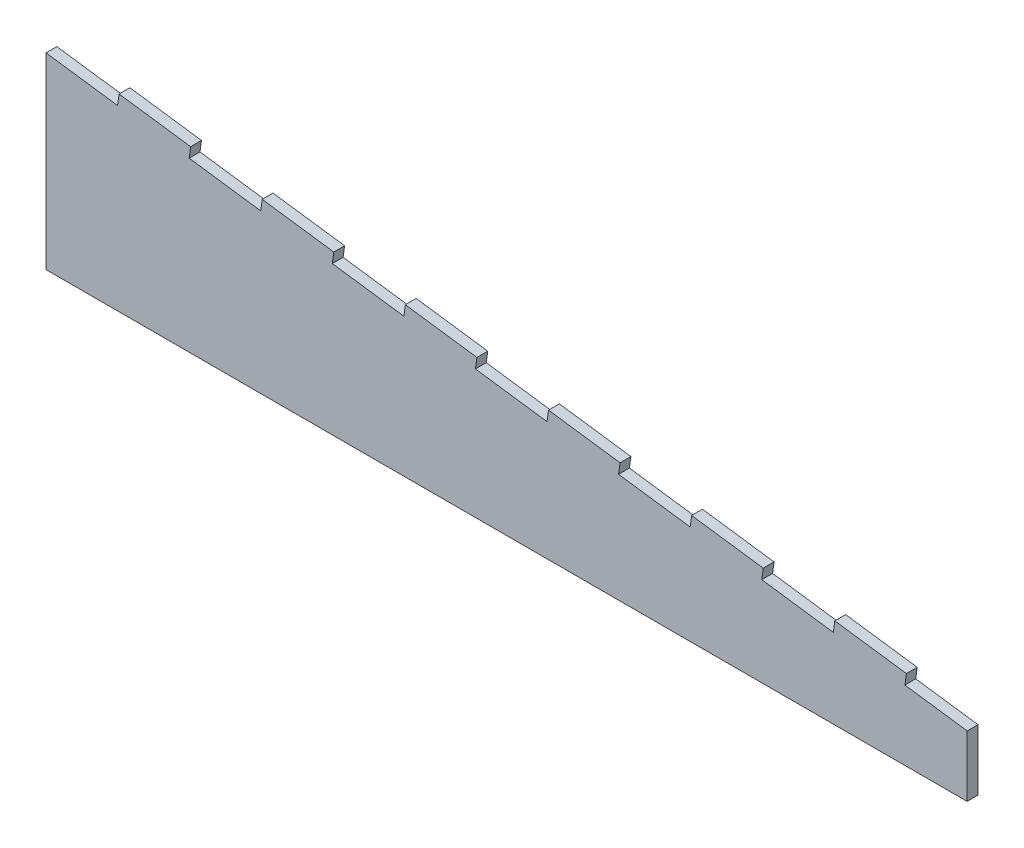
ISO-10303-21;
HEADER;
FILE_DESCRIPTION(('STEP AP214'),'2;1');
FILE_NAME('part.step','',(''),(''),'','','');
FILE_SCHEMA(('AUTOMOTIVE_DESIGN { 1 0 10303 214 1 1 1 1 }'));
ENDSEC;
DATA;
#1=APPLICATION_CONTEXT('core data for automotive mechanical design processes');
#2=APPLICATION_PROTOCOL_DEFINITION('international standard','automotive_design',2000,#1);
#3=PRODUCT_CONTEXT('',#1,'mechanical');
#4=PRODUCT('Part','Part','',(#3));
#5=PRODUCT_RELATED_PRODUCT_CATEGORY('part','',(#4));
#6=PRODUCT_DEFINITION_FORMATION('','',#4);
#7=PRODUCT_DEFINITION_CONTEXT('part definition',#1,'design');
#8=PRODUCT_DEFINITION('design','',#6,#7);
#9=PRODUCT_DEFINITION_SHAPE('','',#8);
#10=(LENGTH_UNIT() NAMED_UNIT(*) SI_UNIT(.MILLI.,.METRE.));
#11=(NAMED_UNIT(*) PLANE_ANGLE_UNIT() SI_UNIT($,.RADIAN.));
#12=(NAMED_UNIT(*) SI_UNIT($,.STERADIAN.) SOLID_ANGLE_UNIT());
#13=UNCERTAINTY_MEASURE_WITH_UNIT(LENGTH_MEASURE(1.E-05),#10,'distance_accuracy_value','');
#14=(GEOMETRIC_REPRESENTATION_CONTEXT(3) GLOBAL_UNCERTAINTY_ASSIGNED_CONTEXT((#13)) GLOBAL_UNIT_ASSIGNED_CONTEXT((#10,
#11,#12)) REPRESENTATION_CONTEXT('',''));
#15=CARTESIAN_POINT('',(0.,0.,0.));
#16=DIRECTION('',(0.,0.,1.));
#17=DIRECTION('',(1.,0.,0.));
#18=AXIS2_PLACEMENT_3D('',#15,#16,#17);
#19=CARTESIAN_POINT('',(0.,19.9375,3.));
#20=DIRECTION('',(-1.,0.,0.));
#21=DIRECTION('',(0.,-1.,0.));
#22=AXIS2_PLACEMENT_3D('',#19,#20,#21);
#23=PLANE('',#22);
#24=DIRECTION('',(0.,0.,1.));
#25=VECTOR('',#24,1.);
#26=CARTESIAN_POINT('',(0.,16.9092734150166,0.));
#27=LINE('',#26,#25);
#28=CARTESIAN_POINT('',(0.,16.9092734150166,0.));
#29=VERTEX_POINT('',#28);
#30=CARTESIAN_POINT('',(0.,16.9092734150166,3.));
#31=VERTEX_POINT('',#30);
#32=EDGE_CURVE('E381',#29,#31,#27,.T.);
#33=ORIENTED_EDGE('',*,*,#32,.T.);
#34=DIRECTION('',(0.,1.,0.));
#35=VECTOR('',#34,1.);
#36=CARTESIAN_POINT('',(0.,19.9375,3.));
#37=LINE('',#36,#35);
#38=CARTESIAN_POINT('',(0.,0.,3.));
#39=VERTEX_POINT('',#38);
#40=EDGE_CURVE('E392',#39,#31,#37,.T.);
#41=ORIENTED_EDGE('',*,*,#40,.F.);
#42=DIRECTION('',(0.,0.,-1.));
#43=VECTOR('',#42,1.);
#44=CARTESIAN_POINT('',(0.,0.,3.));
#45=LINE('',#44,#43);
#46=CARTESIAN_POINT('',(0.,0.,0.));
#47=VERTEX_POINT('',#46);
#48=EDGE_CURVE('E46',#39,#47,#45,.T.);
#49=ORIENTED_EDGE('',*,*,#48,.T.);
#50=DIRECTION('',(0.,1.,0.));
#51=VECTOR('',#50,1.);
#52=CARTESIAN_POINT('',(0.,19.9375,0.));
#53=LINE('',#52,#51);
#54=EDGE_CURVE('E250',#47,#29,#53,.T.);
#55=ORIENTED_EDGE('',*,*,#54,.T.);
#56=EDGE_LOOP('',(#33,#41,#49,#55));
#57=FACE_BOUND('',#56,.T.);
#58=ADVANCED_FACE('F39',(#57),#23,.F.);
#59=CARTESIAN_POINT('',(-255.,55.,3.));
#60=DIRECTION('',(-0.136218340478728,-0.990678839845296,0.));
#61=DIRECTION('',(0.990678839845296,-0.136218340478728,0.));
#62=AXIS2_PLACEMENT_3D('',#59,#60,#61);
#63=PLANE('',#62);
#64=DIRECTION('',(0.,0.,1.));
#65=VECTOR('',#64,1.);
#66=CARTESIAN_POINT('',(-234.777768181658,52.2194431249779,0.));
#67=LINE('',#66,#65);
#68=CARTESIAN_POINT('',(-234.777768181658,52.2194431249779,0.));
#69=VERTEX_POINT('',#68);
#70=CARTESIAN_POINT('',(-234.777768181658,52.2194431249779,3.));
#71=VERTEX_POINT('',#70);
#72=EDGE_CURVE('E61',#69,#71,#67,.T.);
#73=ORIENTED_EDGE('',*,*,#72,.T.);
#74=DIRECTION('',(-0.990678839845296,0.136218340478728,0.));
#75=VECTOR('',#74,1.);
#76=CARTESIAN_POINT('',(-255.,55.,3.));
#77=LINE('',#76,#75);
#78=CARTESIAN_POINT('',(-214.964191384752,49.4950763154034,3.));
#79=VERTEX_POINT('',#78);
#80=EDGE_CURVE('E395',#79,#71,#77,.T.);
#81=ORIENTED_EDGE('',*,*,#80,.F.);
#82=DIRECTION('',(0.,0.,1.));
#83=VECTOR('',#82,1.);
#84=CARTESIAN_POINT('',(-214.964191384752,49.4950763154034,0.));
#85=LINE('',#84,#83);
#86=CARTESIAN_POINT('',(-214.964191384752,49.4950763154034,0.));
#87=VERTEX_POINT('',#86);
#88=EDGE_CURVE('E271',#87,#79,#85,.T.);
#89=ORIENTED_EDGE('',*,*,#88,.F.);
#90=DIRECTION('',(-0.990678839845296,0.136218340478728,0.));
#91=VECTOR('',#90,1.);
#92=CARTESIAN_POINT('',(-255.,55.,0.));
#93=LINE('',#92,#91);
#94=EDGE_CURVE('E407',#87,#69,#93,.T.);
#95=ORIENTED_EDGE('',*,*,#94,.T.);
#96=EDGE_LOOP('',(#73,#81,#89,#95));
#97=FACE_BOUND('',#96,.T.);
#98=ADVANCED_FACE('F433',(#97),#63,.F.);
#99=DIRECTION('',(0.,0.,1.));
#100=VECTOR('',#99,1.);
#101=CARTESIAN_POINT('',(-195.150614587846,46.7707095058288,0.));
#102=LINE('',#101,#100);
#103=CARTESIAN_POINT('',(-195.150614587846,46.7707095058288,0.));
#104=VERTEX_POINT('',#103);
#105=CARTESIAN_POINT('',(-195.150614587846,46.7707095058288,3.));
#106=VERTEX_POINT('',#105);
#107=EDGE_CURVE('E273',#104,#106,#102,.T.);
#108=ORIENTED_EDGE('',*,*,#107,.T.);
#109=CARTESIAN_POINT('',(-175.33703779094,44.0463426962542,3.));
#110=VERTEX_POINT('',#109);
#111=EDGE_CURVE('E399',#110,#106,#77,.T.);
#112=ORIENTED_EDGE('',*,*,#111,.F.);
#113=DIRECTION('',(0.,0.,1.));
#114=VECTOR('',#113,1.);
#115=CARTESIAN_POINT('',(-175.33703779094,44.0463426962542,0.));
#116=LINE('',#115,#114);
#117=CARTESIAN_POINT('',(-175.33703779094,44.0463426962542,0.));
#118=VERTEX_POINT('',#117);
#119=EDGE_CURVE('E296',#118,#110,#116,.T.);
#120=ORIENTED_EDGE('',*,*,#119,.F.);
#121=EDGE_CURVE('E409',#118,#104,#93,.T.);
#122=ORIENTED_EDGE('',*,*,#121,.T.);
#123=EDGE_LOOP('',(#108,#112,#120,#122));
#124=FACE_BOUND('',#123,.T.);
#125=ADVANCED_FACE('F451',(#124),#63,.F.);
#126=DIRECTION('',(0.,0.,1.));
#127=VECTOR('',#126,1.);
#128=CARTESIAN_POINT('',(-155.523460994034,41.3219758866797,0.));
#129=LINE('',#128,#127);
#130=CARTESIAN_POINT('',(-155.523460994034,41.3219758866797,0.));
#131=VERTEX_POINT('',#130);
#132=CARTESIAN_POINT('',(-155.523460994034,41.3219758866797,3.));
#133=VERTEX_POINT('',#132);
#134=EDGE_CURVE('E298',#131,#133,#129,.T.);
#135=ORIENTED_EDGE('',*,*,#134,.T.);
#136=CARTESIAN_POINT('',(-135.709884197128,38.5976090771051,3.));
#137=VERTEX_POINT('',#136);
#138=EDGE_CURVE('E491',#137,#133,#77,.T.);
#139=ORIENTED_EDGE('',*,*,#138,.F.);
#140=DIRECTION('',(0.,0.,1.));
#141=VECTOR('',#140,1.);
#142=CARTESIAN_POINT('',(-135.709884197128,38.5976090771051,0.));
#143=LINE('',#142,#141);
#144=CARTESIAN_POINT('',(-135.709884197128,38.5976090771051,0.));
#145=VERTEX_POINT('',#144);
#146=EDGE_CURVE('E321',#145,#137,#143,.T.);
#147=ORIENTED_EDGE('',*,*,#146,.F.);
#148=EDGE_CURVE('E455',#145,#131,#93,.T.);
#149=ORIENTED_EDGE('',*,*,#148,.T.);
#150=EDGE_LOOP('',(#135,#139,#147,#149));
#151=FACE_BOUND('',#150,.T.);
#152=ADVANCED_FACE('F495',(#151),#63,.F.);
#153=DIRECTION('',(0.,0.,1.));
#154=VECTOR('',#153,1.);
#155=CARTESIAN_POINT('',(-115.896307400223,35.8732422675306,0.));
#156=LINE('',#155,#154);
#157=CARTESIAN_POINT('',(-115.896307400223,35.8732422675306,0.));
#158=VERTEX_POINT('',#157);
#159=CARTESIAN_POINT('',(-115.896307400223,35.8732422675306,3.));
#160=VERTEX_POINT('',#159);
#161=EDGE_CURVE('E323',#158,#160,#156,.T.);
#162=ORIENTED_EDGE('',*,*,#161,.T.);
#163=CARTESIAN_POINT('',(-96.0827306033167,33.148875457956,3.));
#164=VERTEX_POINT('',#163);
#165=EDGE_CURVE('E488',#164,#160,#77,.T.);
#166=ORIENTED_EDGE('',*,*,#165,.F.);
#167=DIRECTION('',(0.,0.,1.));
#168=VECTOR('',#167,1.);
#169=CARTESIAN_POINT('',(-96.0827306033167,33.148875457956,0.));
#170=LINE('',#169,#168);
#171=CARTESIAN_POINT('',(-96.0827306033167,33.148875457956,0.));
#172=VERTEX_POINT('',#171);
#173=EDGE_CURVE('E346',#172,#164,#170,.T.);
#174=ORIENTED_EDGE('',*,*,#173,.F.);
#175=EDGE_CURVE('E457',#172,#158,#93,.T.);
#176=ORIENTED_EDGE('',*,*,#175,.T.);
#177=EDGE_LOOP('',(#162,#166,#174,#176));
#178=FACE_BOUND('',#177,.T.);
#179=ADVANCED_FACE('F533',(#178),#63,.F.);
#180=DIRECTION('',(0.,0.,1.));
#181=VECTOR('',#180,1.);
#182=CARTESIAN_POINT('',(-76.2691538064108,30.4245086483814,0.));
#183=LINE('',#182,#181);
#184=CARTESIAN_POINT('',(-76.2691538064107,30.4245086483814,0.));
#185=VERTEX_POINT('',#184);
#186=CARTESIAN_POINT('',(-76.2691538064108,30.4245086483814,3.));
#187=VERTEX_POINT('',#186);
#188=EDGE_CURVE('E348',#185,#187,#183,.T.);
#189=ORIENTED_EDGE('',*,*,#188,.T.);
#190=CARTESIAN_POINT('',(-56.4555770095048,27.7001418388069,3.));
#191=VERTEX_POINT('',#190);
#192=EDGE_CURVE('E486',#191,#187,#77,.T.);
#193=ORIENTED_EDGE('',*,*,#192,.F.);
#194=DIRECTION('',(0.,0.,1.));
#195=VECTOR('',#194,1.);
#196=CARTESIAN_POINT('',(-56.4555770095048,27.7001418388069,0.));
#197=LINE('',#196,#195);
#198=CARTESIAN_POINT('',(-56.4555770095048,27.7001418388069,0.));
#199=VERTEX_POINT('',#198);
#200=EDGE_CURVE('E370',#199,#191,#197,.T.);
#201=ORIENTED_EDGE('',*,*,#200,.F.);
#202=EDGE_CURVE('E462',#199,#185,#93,.T.);
#203=ORIENTED_EDGE('',*,*,#202,.T.);
#204=EDGE_LOOP('',(#189,#193,#201,#203));
#205=FACE_BOUND('',#204,.T.);
#206=ADVANCED_FACE('F528',(#205),#63,.F.);
#207=DIRECTION('',(0.,0.,1.));
#208=VECTOR('',#207,1.);
#209=CARTESIAN_POINT('',(-36.6420002125989,24.9757750292323,0.));
#210=LINE('',#209,#208);
#211=CARTESIAN_POINT('',(-36.6420002125989,24.9757750292323,0.));
#212=VERTEX_POINT('',#211);
#213=CARTESIAN_POINT('',(-36.6420002125989,24.9757750292323,3.));
#214=VERTEX_POINT('',#213);
#215=EDGE_CURVE('E372',#212,#214,#210,.T.);
#216=ORIENTED_EDGE('',*,*,#215,.T.);
#217=CARTESIAN_POINT('',(-16.828423415693,22.2514082196578,3.));
#218=VERTEX_POINT('',#217);
#219=EDGE_CURVE('E400',#218,#214,#77,.T.);
#220=ORIENTED_EDGE('',*,*,#219,.F.);
#221=DIRECTION('',(0.,0.,1.));
#222=VECTOR('',#221,1.);
#223=CARTESIAN_POINT('',(-16.828423415693,22.2514082196578,0.));
#224=LINE('',#223,#222);
#225=CARTESIAN_POINT('',(-16.828423415693,22.2514082196578,0.));
#226=VERTEX_POINT('',#225);
#227=EDGE_CURVE('E388',#226,#218,#224,.T.);
#228=ORIENTED_EDGE('',*,*,#227,.F.);
#229=EDGE_CURVE('E410',#226,#212,#93,.T.);
#230=ORIENTED_EDGE('',*,*,#229,.T.);
#231=EDGE_LOOP('',(#216,#220,#228,#230));
#232=FACE_BOUND('',#231,.T.);
#233=ADVANCED_FACE('F473',(#232),#63,.F.);
#234=CARTESIAN_POINT('',(-255.,0.,3.));
#235=DIRECTION('',(1.,0.,0.));
#236=DIRECTION('',(0.,1.,0.));
#237=AXIS2_PLACEMENT_3D('',#234,#235,#236);
#238=PLANE('',#237);
#239=DIRECTION('',(0.,0.,1.));
#240=VECTOR('',#239,1.);
#241=CARTESIAN_POINT('',(-255.,51.9717734150166,0.));
#242=LINE('',#241,#240);
#243=CARTESIAN_POINT('',(-255.,51.9717734150166,0.));
#244=VERTEX_POINT('',#243);
#245=CARTESIAN_POINT('',(-255.,51.9717734150166,3.));
#246=VERTEX_POINT('',#245);
#247=EDGE_CURVE('E248',#244,#246,#242,.T.);
#248=ORIENTED_EDGE('',*,*,#247,.F.);
#249=DIRECTION('',(0.,-1.,0.));
#250=VECTOR('',#249,1.);
#251=CARTESIAN_POINT('',(-255.,0.,0.));
#252=LINE('',#251,#250);
#253=CARTESIAN_POINT('',(-255.,0.,0.));
#254=VERTEX_POINT('',#253);
#255=EDGE_CURVE('E241',#244,#254,#252,.T.);
#256=ORIENTED_EDGE('',*,*,#255,.T.);
#257=DIRECTION('',(0.,0.,-1.));
#258=VECTOR('',#257,1.);
#259=CARTESIAN_POINT('',(-255.,0.,3.));
#260=LINE('',#259,#258);
#261=CARTESIAN_POINT('',(-255.,0.,3.));
#262=VERTEX_POINT('',#261);
#263=EDGE_CURVE('E11',#262,#254,#260,.T.);
#264=ORIENTED_EDGE('',*,*,#263,.F.);
#265=DIRECTION('',(0.,-1.,0.));
#266=VECTOR('',#265,1.);
#267=CARTESIAN_POINT('',(-255.,0.,3.));
#268=LINE('',#267,#266);
#269=EDGE_CURVE('E401',#246,#262,#268,.T.);
#270=ORIENTED_EDGE('',*,*,#269,.F.);
#271=EDGE_LOOP('',(#248,#256,#264,#270));
#272=FACE_BOUND('',#271,.T.);
#273=ADVANCED_FACE('F430',(#272),#238,.F.);
#274=CARTESIAN_POINT('',(0.,0.,3.));
#275=DIRECTION('',(0.,0.,-1.));
#276=DIRECTION('',(-1.,0.,0.));
#277=AXIS2_PLACEMENT_3D('',#274,#275,#276);
#278=PLANE('',#277);
#279=DIRECTION('',(-0.990678839845296,0.136218340478728,0.));
#280=VECTOR('',#279,1.);
#281=CARTESIAN_POINT('',(2.28188323956673,16.5955144695763,3.));
#282=LINE('',#281,#280);
#283=CARTESIAN_POINT('',(-235.186423203094,49.247406605442,3.));
#284=VERTEX_POINT('',#283);
#285=EDGE_CURVE('E235',#284,#246,#282,.T.);
#286=ORIENTED_EDGE('',*,*,#285,.T.);
#287=ORIENTED_EDGE('',*,*,#269,.T.);
#288=DIRECTION('',(1.,0.,0.));
#289=VECTOR('',#288,1.);
#290=CARTESIAN_POINT('',(0.,0.,3.));
#291=LINE('',#290,#289);
#292=EDGE_CURVE('E403',#262,#39,#291,.T.);
#293=ORIENTED_EDGE('',*,*,#292,.T.);
#294=ORIENTED_EDGE('',*,*,#40,.T.);
#295=DIRECTION('',(-0.990678839845295,0.136218340478732,0.));
#296=VECTOR('',#295,1.);
#297=CARTESIAN_POINT('',(2.2818832395668,16.5955144695762,3.));
#298=LINE('',#297,#296);
#299=CARTESIAN_POINT('',(-17.2370784371292,19.279371700122,3.));
#300=VERTEX_POINT('',#299);
#301=EDGE_CURVE('E382',#31,#300,#298,.T.);
#302=ORIENTED_EDGE('',*,*,#301,.T.);
#303=DIRECTION('',(0.136218340478731,0.990678839845296,0.));
#304=VECTOR('',#303,1.);
#305=CARTESIAN_POINT('',(-19.5189616766959,2.68385723054575,3.));
#306=LINE('',#305,#304);
#307=EDGE_CURVE('E379',#300,#218,#306,.T.);
#308=ORIENTED_EDGE('',*,*,#307,.T.);
#309=ORIENTED_EDGE('',*,*,#219,.T.);
#310=DIRECTION('',(-0.136218340478728,-0.990678839845296,0.));
#311=VECTOR('',#310,1.);
#312=CARTESIAN_POINT('',(-39.3325384736018,5.40822404012023,3.));
#313=LINE('',#312,#311);
#314=CARTESIAN_POINT('',(-37.0506552340351,22.0037385096965,3.));
#315=VERTEX_POINT('',#314);
#316=EDGE_CURVE('E363',#214,#315,#313,.T.);
#317=ORIENTED_EDGE('',*,*,#316,.T.);
#318=DIRECTION('',(-0.990678839845296,0.136218340478727,0.));
#319=VECTOR('',#318,1.);
#320=CARTESIAN_POINT('',(2.28188323956673,16.5955144695763,3.));
#321=LINE('',#320,#319);
#322=CARTESIAN_POINT('',(-56.864232030941,24.7281053192711,3.));
#323=VERTEX_POINT('',#322);
#324=EDGE_CURVE('E360',#315,#323,#321,.T.);
#325=ORIENTED_EDGE('',*,*,#324,.T.);
#326=DIRECTION('',(0.136218340478727,0.990678839845296,0.));
#327=VECTOR('',#326,1.);
#328=CARTESIAN_POINT('',(-59.1461152705077,8.13259084969477,3.));
#329=LINE('',#328,#327);
#330=EDGE_CURVE('E355',#323,#191,#329,.T.);
#331=ORIENTED_EDGE('',*,*,#330,.T.);
#332=ORIENTED_EDGE('',*,*,#192,.T.);
#333=DIRECTION('',(-0.136218340478729,-0.990678839845296,0.));
#334=VECTOR('',#333,1.);
#335=CARTESIAN_POINT('',(-78.9596920674136,10.8569576592695,3.));
#336=LINE('',#335,#334);
#337=CARTESIAN_POINT('',(-76.6778088278469,27.4524721288456,3.));
#338=VERTEX_POINT('',#337);
#339=EDGE_CURVE('E338',#187,#338,#336,.T.);
#340=ORIENTED_EDGE('',*,*,#339,.T.);
#341=DIRECTION('',(-0.990678839845296,0.136218340478727,0.));
#342=VECTOR('',#341,1.);
#343=CARTESIAN_POINT('',(2.28188323956673,16.5955144695764,3.));
#344=LINE('',#343,#342);
#345=CARTESIAN_POINT('',(-96.4913856247528,30.1768389384202,3.));
#346=VERTEX_POINT('',#345);
#347=EDGE_CURVE('E335',#338,#346,#344,.T.);
#348=ORIENTED_EDGE('',*,*,#347,.T.);
#349=DIRECTION('',(0.136218340478724,0.990678839845296,0.));
#350=VECTOR('',#349,1.);
#351=CARTESIAN_POINT('',(-98.7732688643195,13.5813244688435,3.));
#352=LINE('',#351,#350);
#353=EDGE_CURVE('E330',#346,#164,#352,.T.);
#354=ORIENTED_EDGE('',*,*,#353,.T.);
#355=ORIENTED_EDGE('',*,*,#165,.T.);
#356=DIRECTION('',(-0.136218340478728,-0.990678839845296,0.));
#357=VECTOR('',#356,1.);
#358=CARTESIAN_POINT('',(-118.586845661225,16.3056912784185,3.));
#359=LINE('',#358,#357);
#360=CARTESIAN_POINT('',(-116.304962421659,32.9012057479947,3.));
#361=VERTEX_POINT('',#360);
#362=EDGE_CURVE('E313',#160,#361,#359,.T.);
#363=ORIENTED_EDGE('',*,*,#362,.T.);
#364=DIRECTION('',(-0.990678839845296,0.136218340478728,0.));
#365=VECTOR('',#364,1.);
#366=CARTESIAN_POINT('',(2.28188323956673,16.5955144695762,3.));
#367=LINE('',#366,#365);
#368=CARTESIAN_POINT('',(-136.118539218565,35.6255725575693,3.));
#369=VERTEX_POINT('',#368);
#370=EDGE_CURVE('E310',#361,#369,#367,.T.);
#371=ORIENTED_EDGE('',*,*,#370,.T.);
#372=DIRECTION('',(0.136218340478715,0.990678839845298,0.));
#373=VECTOR('',#372,1.);
#374=CARTESIAN_POINT('',(-138.400422458131,19.0300580879912,3.));
#375=LINE('',#374,#373);
#376=EDGE_CURVE('E305',#369,#137,#375,.T.);
#377=ORIENTED_EDGE('',*,*,#376,.T.);
#378=ORIENTED_EDGE('',*,*,#138,.T.);
#379=DIRECTION('',(-0.136218340478714,-0.990678839845298,0.));
#380=VECTOR('',#379,1.);
#381=CARTESIAN_POINT('',(-158.213999255037,21.7544248975654,3.));
#382=LINE('',#381,#380);
#383=CARTESIAN_POINT('',(-155.93211601547,38.3499393671438,3.));
#384=VERTEX_POINT('',#383);
#385=EDGE_CURVE('E288',#133,#384,#382,.T.);
#386=ORIENTED_EDGE('',*,*,#385,.T.);
#387=DIRECTION('',(-0.990678839845296,0.136218340478727,0.));
#388=VECTOR('',#387,1.);
#389=CARTESIAN_POINT('',(2.28188323956673,16.5955144695764,3.));
#390=LINE('',#389,#388);
#391=CARTESIAN_POINT('',(-175.745692812376,41.0743061767184,3.));
#392=VERTEX_POINT('',#391);
#393=EDGE_CURVE('E285',#384,#392,#390,.T.);
#394=ORIENTED_EDGE('',*,*,#393,.T.);
#395=DIRECTION('',(0.136218340478723,0.990678839845297,0.));
#396=VECTOR('',#395,1.);
#397=CARTESIAN_POINT('',(-178.027576051943,24.4787917071413,3.));
#398=LINE('',#397,#396);
#399=EDGE_CURVE('E280',#392,#110,#398,.T.);
#400=ORIENTED_EDGE('',*,*,#399,.T.);
#401=ORIENTED_EDGE('',*,*,#111,.T.);
#402=DIRECTION('',(-0.136218340478731,-0.990678839845295,0.));
#403=VECTOR('',#402,1.);
#404=CARTESIAN_POINT('',(-197.841152848849,27.2031585167174,3.));
#405=LINE('',#404,#403);
#406=CARTESIAN_POINT('',(-195.559269609282,43.7986729862929,3.));
#407=VERTEX_POINT('',#406);
#408=EDGE_CURVE('E263',#106,#407,#405,.T.);
#409=ORIENTED_EDGE('',*,*,#408,.T.);
#410=DIRECTION('',(-0.990678839845296,0.136218340478728,0.));
#411=VECTOR('',#410,1.);
#412=CARTESIAN_POINT('',(2.28188323956672,16.5955144695761,3.));
#413=LINE('',#412,#411);
#414=CARTESIAN_POINT('',(-215.372846406188,46.5230397958675,3.));
#415=VERTEX_POINT('',#414);
#416=EDGE_CURVE('E260',#407,#415,#413,.T.);
#417=ORIENTED_EDGE('',*,*,#416,.T.);
#418=DIRECTION('',(0.136218340478733,0.990678839845295,0.));
#419=VECTOR('',#418,1.);
#420=CARTESIAN_POINT('',(-217.654729645755,29.9275253262923,3.));
#421=LINE('',#420,#419);
#422=EDGE_CURVE('E255',#415,#79,#421,.T.);
#423=ORIENTED_EDGE('',*,*,#422,.T.);
#424=ORIENTED_EDGE('',*,*,#80,.T.);
#425=DIRECTION('',(-0.136218340478731,-0.990678839845296,0.));
#426=VECTOR('',#425,1.);
#427=CARTESIAN_POINT('',(-237.468306442661,32.6518921358666,3.));
#428=LINE('',#427,#426);
#429=EDGE_CURVE('E242',#71,#284,#428,.T.);
#430=ORIENTED_EDGE('',*,*,#429,.T.);
#431=EDGE_LOOP('',(#286,#287,#293,#294,#302,#308,#309,#317,#325,#331,#332,#340,#348,#354,#355,
#363,#371,#377,#378,#386,#394,#400,#401,#409,#417,#423,#424,#430));
#432=FACE_BOUND('',#431,.T.);
#433=ADVANCED_FACE('F425',(#432),#278,.F.);
#434=CARTESIAN_POINT('',(0.,0.,0.));
#435=DIRECTION('',(0.,0.,-1.));
#436=DIRECTION('',(-1.,0.,0.));
#437=AXIS2_PLACEMENT_3D('',#434,#435,#436);
#438=PLANE('',#437);
#439=ORIENTED_EDGE('',*,*,#255,.F.);
#440=DIRECTION('',(-0.990678839845296,0.136218340478728,0.));
#441=VECTOR('',#440,1.);
#442=CARTESIAN_POINT('',(2.28188323956673,16.5955144695763,0.));
#443=LINE('',#442,#441);
#444=CARTESIAN_POINT('',(-235.186423203094,49.247406605442,0.));
#445=VERTEX_POINT('',#444);
#446=EDGE_CURVE('E229',#445,#244,#443,.T.);
#447=ORIENTED_EDGE('',*,*,#446,.F.);
#448=DIRECTION('',(-0.136218340478731,-0.990678839845296,0.));
#449=VECTOR('',#448,1.);
#450=CARTESIAN_POINT('',(-237.468306442661,32.6518921358666,0.));
#451=LINE('',#450,#449);
#452=EDGE_CURVE('E220',#69,#445,#451,.T.);
#453=ORIENTED_EDGE('',*,*,#452,.F.);
#454=ORIENTED_EDGE('',*,*,#94,.F.);
#455=DIRECTION('',(0.136218340478733,0.990678839845295,0.));
#456=VECTOR('',#455,1.);
#457=CARTESIAN_POINT('',(-217.654729645755,29.9275253262923,0.));
#458=LINE('',#457,#456);
#459=CARTESIAN_POINT('',(-215.372846406188,46.5230397958675,0.));
#460=VERTEX_POINT('',#459);
#461=EDGE_CURVE('E257',#460,#87,#458,.T.);
#462=ORIENTED_EDGE('',*,*,#461,.F.);
#463=DIRECTION('',(-0.990678839845296,0.136218340478728,0.));
#464=VECTOR('',#463,1.);
#465=CARTESIAN_POINT('',(2.28188323956672,16.5955144695761,0.));
#466=LINE('',#465,#464);
#467=CARTESIAN_POINT('',(-195.559269609282,43.7986729862929,0.));
#468=VERTEX_POINT('',#467);
#469=EDGE_CURVE('E252',#468,#460,#466,.T.);
#470=ORIENTED_EDGE('',*,*,#469,.F.);
#471=DIRECTION('',(-0.136218340478731,-0.990678839845295,0.));
#472=VECTOR('',#471,1.);
#473=CARTESIAN_POINT('',(-197.841152848849,27.2031585167174,0.));
#474=LINE('',#473,#472);
#475=EDGE_CURVE('E254',#104,#468,#474,.T.);
#476=ORIENTED_EDGE('',*,*,#475,.F.);
#477=ORIENTED_EDGE('',*,*,#121,.F.);
#478=DIRECTION('',(0.136218340478723,0.990678839845297,0.));
#479=VECTOR('',#478,1.);
#480=CARTESIAN_POINT('',(-178.027576051943,24.4787917071413,0.));
#481=LINE('',#480,#479);
#482=CARTESIAN_POINT('',(-175.745692812376,41.0743061767184,0.));
#483=VERTEX_POINT('',#482);
#484=EDGE_CURVE('E282',#483,#118,#481,.T.);
#485=ORIENTED_EDGE('',*,*,#484,.F.);
#486=DIRECTION('',(-0.990678839845296,0.136218340478727,0.));
#487=VECTOR('',#486,1.);
#488=CARTESIAN_POINT('',(2.28188323956673,16.5955144695764,0.));
#489=LINE('',#488,#487);
#490=CARTESIAN_POINT('',(-155.93211601547,38.3499393671438,0.));
#491=VERTEX_POINT('',#490);
#492=EDGE_CURVE('E277',#491,#483,#489,.T.);
#493=ORIENTED_EDGE('',*,*,#492,.F.);
#494=DIRECTION('',(-0.136218340478714,-0.990678839845298,0.));
#495=VECTOR('',#494,1.);
#496=CARTESIAN_POINT('',(-158.213999255037,21.7544248975654,0.));
#497=LINE('',#496,#495);
#498=EDGE_CURVE('E279',#131,#491,#497,.T.);
#499=ORIENTED_EDGE('',*,*,#498,.F.);
#500=ORIENTED_EDGE('',*,*,#148,.F.);
#501=DIRECTION('',(0.136218340478715,0.990678839845298,0.));
#502=VECTOR('',#501,1.);
#503=CARTESIAN_POINT('',(-138.400422458131,19.0300580879912,0.));
#504=LINE('',#503,#502);
#505=CARTESIAN_POINT('',(-136.118539218565,35.6255725575693,0.));
#506=VERTEX_POINT('',#505);
#507=EDGE_CURVE('E307',#506,#145,#504,.T.);
#508=ORIENTED_EDGE('',*,*,#507,.F.);
#509=DIRECTION('',(-0.990678839845296,0.136218340478728,0.));
#510=VECTOR('',#509,1.);
#511=CARTESIAN_POINT('',(2.28188323956673,16.5955144695762,0.));
#512=LINE('',#511,#510);
#513=CARTESIAN_POINT('',(-116.304962421659,32.9012057479947,0.));
#514=VERTEX_POINT('',#513);
#515=EDGE_CURVE('E302',#514,#506,#512,.T.);
#516=ORIENTED_EDGE('',*,*,#515,.F.);
#517=DIRECTION('',(-0.136218340478728,-0.990678839845296,0.));
#518=VECTOR('',#517,1.);
#519=CARTESIAN_POINT('',(-118.586845661225,16.3056912784185,0.));
#520=LINE('',#519,#518);
#521=EDGE_CURVE('E304',#158,#514,#520,.T.);
#522=ORIENTED_EDGE('',*,*,#521,.F.);
#523=ORIENTED_EDGE('',*,*,#175,.F.);
#524=DIRECTION('',(0.136218340478724,0.990678839845296,0.));
#525=VECTOR('',#524,1.);
#526=CARTESIAN_POINT('',(-98.7732688643195,13.5813244688435,0.));
#527=LINE('',#526,#525);
#528=CARTESIAN_POINT('',(-96.4913856247528,30.1768389384202,0.));
#529=VERTEX_POINT('',#528);
#530=EDGE_CURVE('E332',#529,#172,#527,.T.);
#531=ORIENTED_EDGE('',*,*,#530,.F.);
#532=DIRECTION('',(-0.990678839845296,0.136218340478727,0.));
#533=VECTOR('',#532,1.);
#534=CARTESIAN_POINT('',(2.28188323956673,16.5955144695764,0.));
#535=LINE('',#534,#533);
#536=CARTESIAN_POINT('',(-76.6778088278469,27.4524721288456,0.));
#537=VERTEX_POINT('',#536);
#538=EDGE_CURVE('E327',#537,#529,#535,.T.);
#539=ORIENTED_EDGE('',*,*,#538,.F.);
#540=DIRECTION('',(-0.136218340478729,-0.990678839845296,0.));
#541=VECTOR('',#540,1.);
#542=CARTESIAN_POINT('',(-78.9596920674136,10.8569576592695,0.));
#543=LINE('',#542,#541);
#544=EDGE_CURVE('E329',#185,#537,#543,.T.);
#545=ORIENTED_EDGE('',*,*,#544,.F.);
#546=ORIENTED_EDGE('',*,*,#202,.F.);
#547=DIRECTION('',(0.136218340478727,0.990678839845296,0.));
#548=VECTOR('',#547,1.);
#549=CARTESIAN_POINT('',(-59.1461152705077,8.13259084969477,0.));
#550=LINE('',#549,#548);
#551=CARTESIAN_POINT('',(-56.864232030941,24.7281053192711,0.));
#552=VERTEX_POINT('',#551);
#553=EDGE_CURVE('E357',#552,#199,#550,.T.);
#554=ORIENTED_EDGE('',*,*,#553,.F.);
#555=DIRECTION('',(-0.990678839845296,0.136218340478727,0.));
#556=VECTOR('',#555,1.);
#557=CARTESIAN_POINT('',(2.28188323956673,16.5955144695763,0.));
#558=LINE('',#557,#556);
#559=CARTESIAN_POINT('',(-37.0506552340351,22.0037385096965,0.));
#560=VERTEX_POINT('',#559);
#561=EDGE_CURVE('E352',#560,#552,#558,.T.);
#562=ORIENTED_EDGE('',*,*,#561,.F.);
#563=DIRECTION('',(-0.136218340478728,-0.990678839845296,0.));
#564=VECTOR('',#563,1.);
#565=CARTESIAN_POINT('',(-39.3325384736018,5.40822404012023,0.));
#566=LINE('',#565,#564);
#567=EDGE_CURVE('E354',#212,#560,#566,.T.);
#568=ORIENTED_EDGE('',*,*,#567,.F.);
#569=ORIENTED_EDGE('',*,*,#229,.F.);
#570=DIRECTION('',(0.136218340478731,0.990678839845296,0.));
#571=VECTOR('',#570,1.);
#572=CARTESIAN_POINT('',(-19.5189616766959,2.68385723054575,0.));
#573=LINE('',#572,#571);
#574=CARTESIAN_POINT('',(-17.2370784371292,19.279371700122,0.));
#575=VERTEX_POINT('',#574);
#576=EDGE_CURVE('E378',#575,#226,#573,.T.);
#577=ORIENTED_EDGE('',*,*,#576,.F.);
#578=DIRECTION('',(-0.990678839845295,0.136218340478732,0.));
#579=VECTOR('',#578,1.);
#580=CARTESIAN_POINT('',(2.2818832395668,16.5955144695762,0.));
#581=LINE('',#580,#579);
#582=EDGE_CURVE('E376',#29,#575,#581,.T.);
#583=ORIENTED_EDGE('',*,*,#582,.F.);
#584=ORIENTED_EDGE('',*,*,#54,.F.);
#585=DIRECTION('',(1.,0.,0.));
#586=VECTOR('',#585,1.);
#587=CARTESIAN_POINT('',(0.,0.,0.));
#588=LINE('',#587,#586);
#589=EDGE_CURVE('E396',#254,#47,#588,.T.);
#590=ORIENTED_EDGE('',*,*,#589,.F.);
#591=EDGE_LOOP('',(#439,#447,#453,#454,#462,#470,#476,#477,#485,#493,#499,#500,#508,#516,#522,
#523,#531,#539,#545,#546,#554,#562,#568,#569,#577,#583,#584,#590));
#592=FACE_BOUND('',#591,.T.);
#593=ADVANCED_FACE('F239',(#592),#438,.T.);
#594=CARTESIAN_POINT('',(0.,0.,3.));
#595=DIRECTION('',(0.,1.,0.));
#596=DIRECTION('',(-1.,0.,0.));
#597=AXIS2_PLACEMENT_3D('',#594,#595,#596);
#598=PLANE('',#597);
#599=ORIENTED_EDGE('',*,*,#589,.T.);
#600=ORIENTED_EDGE('',*,*,#48,.F.);
#601=ORIENTED_EDGE('',*,*,#292,.F.);
#602=ORIENTED_EDGE('',*,*,#263,.T.);
#603=EDGE_LOOP('',(#599,#600,#601,#602));
#604=FACE_BOUND('',#603,.T.);
#605=ADVANCED_FACE('F428',(#604),#598,.F.);
#606=CARTESIAN_POINT('',(2.2818832395668,16.5955144695762,0.));
#607=DIRECTION('',(0.136218340478732,0.990678839845295,0.));
#608=DIRECTION('',(-0.990678839845295,0.136218340478733,0.));
#609=AXIS2_PLACEMENT_3D('',#606,#607,#608);
#610=PLANE('',#609);
#611=ORIENTED_EDGE('',*,*,#301,.F.);
#612=ORIENTED_EDGE('',*,*,#32,.F.);
#613=ORIENTED_EDGE('',*,*,#582,.T.);
#614=DIRECTION('',(0.,0.,1.));
#615=VECTOR('',#614,1.);
#616=CARTESIAN_POINT('',(-17.2370784371292,19.279371700122,0.));
#617=LINE('',#616,#615);
#618=EDGE_CURVE('E53',#575,#300,#617,.T.);
#619=ORIENTED_EDGE('',*,*,#618,.T.);
#620=EDGE_LOOP('',(#611,#612,#613,#619));
#621=FACE_BOUND('',#620,.T.);
#622=ADVANCED_FACE('F423',(#621),#610,.T.);
#623=CARTESIAN_POINT('',(-19.5189616766959,2.68385723054575,0.));
#624=DIRECTION('',(0.990678839845295,-0.136218340478731,0.));
#625=DIRECTION('',(0.136218340478731,0.990678839845296,0.));
#626=AXIS2_PLACEMENT_3D('',#623,#624,#625);
#627=PLANE('',#626);
#628=ORIENTED_EDGE('',*,*,#307,.F.);
#629=ORIENTED_EDGE('',*,*,#618,.F.);
#630=ORIENTED_EDGE('',*,*,#576,.T.);
#631=ORIENTED_EDGE('',*,*,#227,.T.);
#632=EDGE_LOOP('',(#628,#629,#630,#631));
#633=FACE_BOUND('',#632,.T.);
#634=ADVANCED_FACE('F582',(#633),#627,.T.);
#635=CARTESIAN_POINT('',(2.28188323956673,16.5955144695763,0.));
#636=DIRECTION('',(0.136218340478727,0.990678839845296,0.));
#637=DIRECTION('',(-0.990678839845296,0.136218340478727,0.));
#638=AXIS2_PLACEMENT_3D('',#635,#636,#637);
#639=PLANE('',#638);
#640=ORIENTED_EDGE('',*,*,#324,.F.);
#641=DIRECTION('',(0.,0.,1.));
#642=VECTOR('',#641,1.);
#643=CARTESIAN_POINT('',(-37.0506552340351,22.0037385096965,0.));
#644=LINE('',#643,#642);
#645=EDGE_CURVE('E359',#560,#315,#644,.T.);
#646=ORIENTED_EDGE('',*,*,#645,.F.);
#647=ORIENTED_EDGE('',*,*,#561,.T.);
#648=DIRECTION('',(0.,0.,1.));
#649=VECTOR('',#648,1.);
#650=CARTESIAN_POINT('',(-56.864232030941,24.7281053192711,0.));
#651=LINE('',#650,#649);
#652=EDGE_CURVE('E339',#552,#323,#651,.T.);
#653=ORIENTED_EDGE('',*,*,#652,.T.);
#654=EDGE_LOOP('',(#640,#646,#647,#653));
#655=FACE_BOUND('',#654,.T.);
#656=ADVANCED_FACE('F484',(#655),#639,.T.);
#657=CARTESIAN_POINT('',(-59.1461152705077,8.13259084969477,0.));
#658=DIRECTION('',(0.990678839845296,-0.136218340478727,0.));
#659=DIRECTION('',(0.136218340478727,0.990678839845296,0.));
#660=AXIS2_PLACEMENT_3D('',#657,#658,#659);
#661=PLANE('',#660);
#662=ORIENTED_EDGE('',*,*,#330,.F.);
#663=ORIENTED_EDGE('',*,*,#652,.F.);
#664=ORIENTED_EDGE('',*,*,#553,.T.);
#665=ORIENTED_EDGE('',*,*,#200,.T.);
#666=EDGE_LOOP('',(#662,#663,#664,#665));
#667=FACE_BOUND('',#666,.T.);
#668=ADVANCED_FACE('F574',(#667),#661,.T.);
#669=CARTESIAN_POINT('',(-39.3325384736018,5.40822404012023,0.));
#670=DIRECTION('',(-0.990678839845296,0.136218340478728,0.));
#671=DIRECTION('',(-0.136218340478728,-0.990678839845296,0.));
#672=AXIS2_PLACEMENT_3D('',#669,#670,#671);
#673=PLANE('',#672);
#674=ORIENTED_EDGE('',*,*,#316,.F.);
#675=ORIENTED_EDGE('',*,*,#215,.F.);
#676=ORIENTED_EDGE('',*,*,#567,.T.);
#677=ORIENTED_EDGE('',*,*,#645,.T.);
#678=EDGE_LOOP('',(#674,#675,#676,#677));
#679=FACE_BOUND('',#678,.T.);
#680=ADVANCED_FACE('F481',(#679),#673,.T.);
#681=CARTESIAN_POINT('',(2.28188323956673,16.5955144695764,0.));
#682=DIRECTION('',(0.136218340478727,0.990678839845296,0.));
#683=DIRECTION('',(-0.990678839845296,0.136218340478727,0.));
#684=AXIS2_PLACEMENT_3D('',#681,#682,#683);
#685=PLANE('',#684);
#686=ORIENTED_EDGE('',*,*,#347,.F.);
#687=DIRECTION('',(0.,0.,1.));
#688=VECTOR('',#687,1.);
#689=CARTESIAN_POINT('',(-76.6778088278469,27.4524721288456,0.));
#690=LINE('',#689,#688);
#691=EDGE_CURVE('E334',#537,#338,#690,.T.);
#692=ORIENTED_EDGE('',*,*,#691,.F.);
#693=ORIENTED_EDGE('',*,*,#538,.T.);
#694=DIRECTION('',(0.,0.,1.));
#695=VECTOR('',#694,1.);
#696=CARTESIAN_POINT('',(-96.4913856247528,30.1768389384202,0.));
#697=LINE('',#696,#695);
#698=EDGE_CURVE('E314',#529,#346,#697,.T.);
#699=ORIENTED_EDGE('',*,*,#698,.T.);
#700=EDGE_LOOP('',(#686,#692,#693,#699));
#701=FACE_BOUND('',#700,.T.);
#702=ADVANCED_FACE('F546',(#701),#685,.T.);
#703=CARTESIAN_POINT('',(-98.7732688643195,13.5813244688435,0.));
#704=DIRECTION('',(0.990678839845296,-0.136218340478724,0.));
#705=DIRECTION('',(0.136218340478724,0.990678839845296,0.));
#706=AXIS2_PLACEMENT_3D('',#703,#704,#705);
#707=PLANE('',#706);
#708=ORIENTED_EDGE('',*,*,#353,.F.);
#709=ORIENTED_EDGE('',*,*,#698,.F.);
#710=ORIENTED_EDGE('',*,*,#530,.T.);
#711=ORIENTED_EDGE('',*,*,#173,.T.);
#712=EDGE_LOOP('',(#708,#709,#710,#711));
#713=FACE_BOUND('',#712,.T.);
#714=ADVANCED_FACE('F548',(#713),#707,.T.);
#715=CARTESIAN_POINT('',(-78.9596920674136,10.8569576592695,0.));
#716=DIRECTION('',(-0.990678839845296,0.136218340478729,0.));
#717=DIRECTION('',(-0.136218340478729,-0.990678839845296,0.));
#718=AXIS2_PLACEMENT_3D('',#715,#716,#717);
#719=PLANE('',#718);
#720=ORIENTED_EDGE('',*,*,#339,.F.);
#721=ORIENTED_EDGE('',*,*,#188,.F.);
#722=ORIENTED_EDGE('',*,*,#544,.T.);
#723=ORIENTED_EDGE('',*,*,#691,.T.);
#724=EDGE_LOOP('',(#720,#721,#722,#723));
#725=FACE_BOUND('',#724,.T.);
#726=ADVANCED_FACE('F539',(#725),#719,.T.);
#727=CARTESIAN_POINT('',(2.28188323956673,16.5955144695762,0.));
#728=DIRECTION('',(0.136218340478728,0.990678839845296,0.));
#729=DIRECTION('',(-0.990678839845296,0.136218340478728,0.));
#730=AXIS2_PLACEMENT_3D('',#727,#728,#729);
#731=PLANE('',#730);
#732=ORIENTED_EDGE('',*,*,#370,.F.);
#733=DIRECTION('',(0.,0.,1.));
#734=VECTOR('',#733,1.);
#735=CARTESIAN_POINT('',(-116.304962421659,32.9012057479947,0.));
#736=LINE('',#735,#734);
#737=EDGE_CURVE('E309',#514,#361,#736,.T.);
#738=ORIENTED_EDGE('',*,*,#737,.F.);
#739=ORIENTED_EDGE('',*,*,#515,.T.);
#740=DIRECTION('',(0.,0.,1.));
#741=VECTOR('',#740,1.);
#742=CARTESIAN_POINT('',(-136.118539218565,35.6255725575693,0.));
#743=LINE('',#742,#741);
#744=EDGE_CURVE('E289',#506,#369,#743,.T.);
#745=ORIENTED_EDGE('',*,*,#744,.T.);
#746=EDGE_LOOP('',(#732,#738,#739,#745));
#747=FACE_BOUND('',#746,.T.);
#748=ADVANCED_FACE('F556',(#747),#731,.T.);
#749=CARTESIAN_POINT('',(-138.400422458131,19.0300580879912,0.));
#750=DIRECTION('',(0.990678839845298,-0.136218340478715,0.));
#751=DIRECTION('',(0.136218340478715,0.990678839845298,0.));
#752=AXIS2_PLACEMENT_3D('',#749,#750,#751);
#753=PLANE('',#752);
#754=ORIENTED_EDGE('',*,*,#376,.F.);
#755=ORIENTED_EDGE('',*,*,#744,.F.);
#756=ORIENTED_EDGE('',*,*,#507,.T.);
#757=ORIENTED_EDGE('',*,*,#146,.T.);
#758=EDGE_LOOP('',(#754,#755,#756,#757));
#759=FACE_BOUND('',#758,.T.);
#760=ADVANCED_FACE('F558',(#759),#753,.T.);
#761=CARTESIAN_POINT('',(-118.586845661225,16.3056912784185,0.));
#762=DIRECTION('',(-0.990678839845296,0.136218340478728,0.));
#763=DIRECTION('',(-0.136218340478728,-0.990678839845296,0.));
#764=AXIS2_PLACEMENT_3D('',#761,#762,#763);
#765=PLANE('',#764);
#766=ORIENTED_EDGE('',*,*,#362,.F.);
#767=ORIENTED_EDGE('',*,*,#161,.F.);
#768=ORIENTED_EDGE('',*,*,#521,.T.);
#769=ORIENTED_EDGE('',*,*,#737,.T.);
#770=EDGE_LOOP('',(#766,#767,#768,#769));
#771=FACE_BOUND('',#770,.T.);
#772=ADVANCED_FACE('F515',(#771),#765,.T.);
#773=CARTESIAN_POINT('',(2.28188323956673,16.5955144695764,0.));
#774=DIRECTION('',(0.136218340478727,0.990678839845296,0.));
#775=DIRECTION('',(-0.990678839845296,0.136218340478727,0.));
#776=AXIS2_PLACEMENT_3D('',#773,#774,#775);
#777=PLANE('',#776);
#778=ORIENTED_EDGE('',*,*,#393,.F.);
#779=DIRECTION('',(0.,0.,1.));
#780=VECTOR('',#779,1.);
#781=CARTESIAN_POINT('',(-155.93211601547,38.3499393671438,0.));
#782=LINE('',#781,#780);
#783=EDGE_CURVE('E284',#491,#384,#782,.T.);
#784=ORIENTED_EDGE('',*,*,#783,.F.);
#785=ORIENTED_EDGE('',*,*,#492,.T.);
#786=DIRECTION('',(0.,0.,1.));
#787=VECTOR('',#786,1.);
#788=CARTESIAN_POINT('',(-175.745692812376,41.0743061767184,0.));
#789=LINE('',#788,#787);
#790=EDGE_CURVE('E264',#483,#392,#789,.T.);
#791=ORIENTED_EDGE('',*,*,#790,.T.);
#792=EDGE_LOOP('',(#778,#784,#785,#791));
#793=FACE_BOUND('',#792,.T.);
#794=ADVANCED_FACE('F505',(#793),#777,.T.);
#795=CARTESIAN_POINT('',(-178.027576051943,24.4787917071413,0.));
#796=DIRECTION('',(0.990678839845296,-0.136218340478723,0.));
#797=DIRECTION('',(0.136218340478723,0.990678839845297,0.));
#798=AXIS2_PLACEMENT_3D('',#795,#796,#797);
#799=PLANE('',#798);
#800=ORIENTED_EDGE('',*,*,#399,.F.);
#801=ORIENTED_EDGE('',*,*,#790,.F.);
#802=ORIENTED_EDGE('',*,*,#484,.T.);
#803=ORIENTED_EDGE('',*,*,#119,.T.);
#804=EDGE_LOOP('',(#800,#801,#802,#803));
#805=FACE_BOUND('',#804,.T.);
#806=ADVANCED_FACE('F507',(#805),#799,.T.);
#807=CARTESIAN_POINT('',(-158.213999255037,21.7544248975654,0.));
#808=DIRECTION('',(-0.990678839845298,0.136218340478714,0.));
#809=DIRECTION('',(-0.136218340478715,-0.990678839845298,0.));
#810=AXIS2_PLACEMENT_3D('',#807,#808,#809);
#811=PLANE('',#810);
#812=ORIENTED_EDGE('',*,*,#385,.F.);
#813=ORIENTED_EDGE('',*,*,#134,.F.);
#814=ORIENTED_EDGE('',*,*,#498,.T.);
#815=ORIENTED_EDGE('',*,*,#783,.T.);
#816=EDGE_LOOP('',(#812,#813,#814,#815));
#817=FACE_BOUND('',#816,.T.);
#818=ADVANCED_FACE('F498',(#817),#811,.T.);
#819=CARTESIAN_POINT('',(2.28188323956672,16.5955144695761,0.));
#820=DIRECTION('',(0.136218340478728,0.990678839845296,0.));
#821=DIRECTION('',(-0.990678839845296,0.136218340478728,0.));
#822=AXIS2_PLACEMENT_3D('',#819,#820,#821);
#823=PLANE('',#822);
#824=ORIENTED_EDGE('',*,*,#416,.F.);
#825=DIRECTION('',(0.,0.,1.));
#826=VECTOR('',#825,1.);
#827=CARTESIAN_POINT('',(-195.559269609282,43.7986729862929,0.));
#828=LINE('',#827,#826);
#829=EDGE_CURVE('E259',#468,#407,#828,.T.);
#830=ORIENTED_EDGE('',*,*,#829,.F.);
#831=ORIENTED_EDGE('',*,*,#469,.T.);
#832=DIRECTION('',(0.,0.,1.));
#833=VECTOR('',#832,1.);
#834=CARTESIAN_POINT('',(-215.372846406188,46.5230397958675,0.));
#835=LINE('',#834,#833);
#836=EDGE_CURVE('E246',#460,#415,#835,.T.);
#837=ORIENTED_EDGE('',*,*,#836,.T.);
#838=EDGE_LOOP('',(#824,#830,#831,#837));
#839=FACE_BOUND('',#838,.T.);
#840=ADVANCED_FACE('F443',(#839),#823,.T.);
#841=CARTESIAN_POINT('',(-217.654729645755,29.9275253262923,0.));
#842=DIRECTION('',(0.990678839845295,-0.136218340478733,0.));
#843=DIRECTION('',(0.136218340478733,0.990678839845295,0.));
#844=AXIS2_PLACEMENT_3D('',#841,#842,#843);
#845=PLANE('',#844);
#846=ORIENTED_EDGE('',*,*,#422,.F.);
#847=ORIENTED_EDGE('',*,*,#836,.F.);
#848=ORIENTED_EDGE('',*,*,#461,.T.);
#849=ORIENTED_EDGE('',*,*,#88,.T.);
#850=EDGE_LOOP('',(#846,#847,#848,#849));
#851=FACE_BOUND('',#850,.T.);
#852=ADVANCED_FACE('F440',(#851),#845,.T.);
#853=CARTESIAN_POINT('',(-197.841152848849,27.2031585167174,0.));
#854=DIRECTION('',(-0.990678839845295,0.136218340478731,0.));
#855=DIRECTION('',(-0.136218340478731,-0.990678839845295,0.));
#856=AXIS2_PLACEMENT_3D('',#853,#854,#855);
#857=PLANE('',#856);
#858=ORIENTED_EDGE('',*,*,#408,.F.);
#859=ORIENTED_EDGE('',*,*,#107,.F.);
#860=ORIENTED_EDGE('',*,*,#475,.T.);
#861=ORIENTED_EDGE('',*,*,#829,.T.);
#862=EDGE_LOOP('',(#858,#859,#860,#861));
#863=FACE_BOUND('',#862,.T.);
#864=ADVANCED_FACE('F448',(#863),#857,.T.);
#865=CARTESIAN_POINT('',(2.28188323956673,16.5955144695763,0.));
#866=DIRECTION('',(0.136218340478728,0.990678839845296,0.));
#867=DIRECTION('',(-0.990678839845296,0.136218340478728,0.));
#868=AXIS2_PLACEMENT_3D('',#865,#866,#867);
#869=PLANE('',#868);
#870=ORIENTED_EDGE('',*,*,#285,.F.);
#871=DIRECTION('',(0.,0.,1.));
#872=VECTOR('',#871,1.);
#873=CARTESIAN_POINT('',(-235.186423203094,49.247406605442,0.));
#874=LINE('',#873,#872);
#875=EDGE_CURVE('E223',#445,#284,#874,.T.);
#876=ORIENTED_EDGE('',*,*,#875,.F.);
#877=ORIENTED_EDGE('',*,*,#446,.T.);
#878=ORIENTED_EDGE('',*,*,#247,.T.);
#879=EDGE_LOOP('',(#870,#876,#877,#878));
#880=FACE_BOUND('',#879,.T.);
#881=ADVANCED_FACE('F232',(#880),#869,.T.);
#882=CARTESIAN_POINT('',(-237.468306442661,32.6518921358666,0.));
#883=DIRECTION('',(-0.990678839845295,0.136218340478731,0.));
#884=DIRECTION('',(-0.136218340478731,-0.990678839845295,0.));
#885=AXIS2_PLACEMENT_3D('',#882,#883,#884);
#886=PLANE('',#885);
#887=ORIENTED_EDGE('',*,*,#429,.F.);
#888=ORIENTED_EDGE('',*,*,#72,.F.);
#889=ORIENTED_EDGE('',*,*,#452,.T.);
#890=ORIENTED_EDGE('',*,*,#875,.T.);
#891=EDGE_LOOP('',(#887,#888,#889,#890));
#892=FACE_BOUND('',#891,.T.);
#893=ADVANCED_FACE('F222',(#892),#886,.T.);
#894=CLOSED_SHELL('',(#58,#98,#125,#152,#179,#206,#233,#273,#433,#593,#605,#622,#634,#656,#668,
#680,#702,#714,#726,#748,#760,#772,#794,#806,#818,#840,#852,#864,#881,#893));
#895=MANIFOLD_SOLID_BREP('B2',#894);
#896=ADVANCED_BREP_SHAPE_REPRESENTATION('',(#18,#895),#14);
#897=SHAPE_DEFINITION_REPRESENTATION(#9,#896);
ENDSEC;
END-ISO-10303-21;
